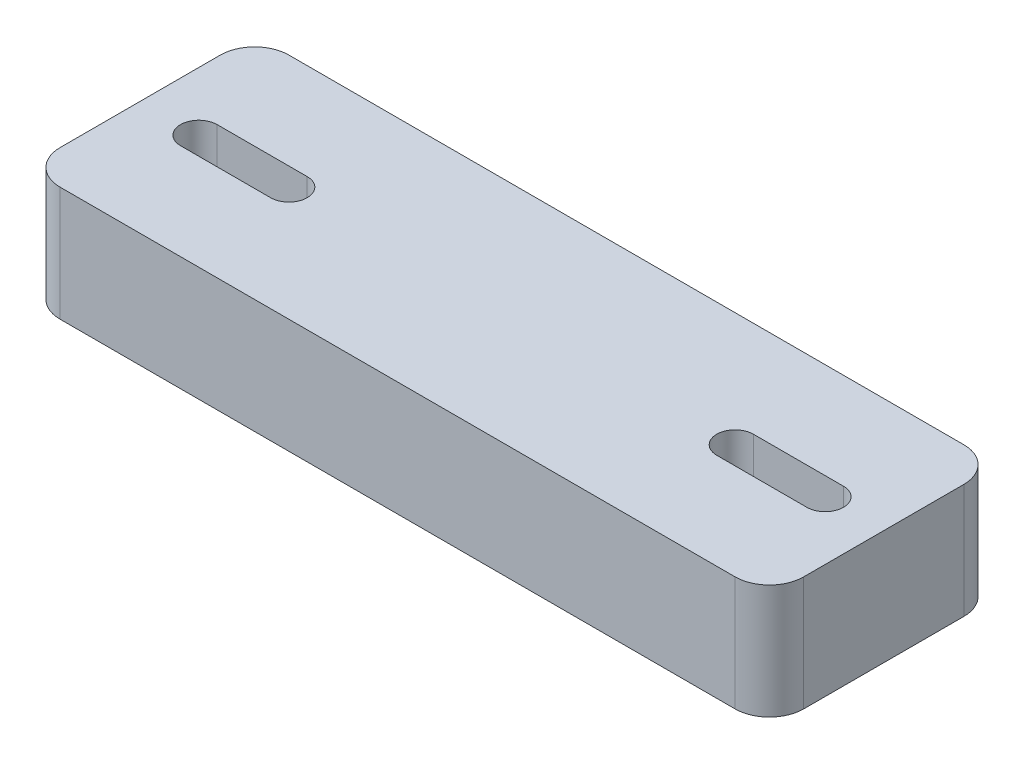
ISO-10303-21;
HEADER;
FILE_DESCRIPTION(('STEP AP214'),'2;1');
FILE_NAME('part.step','',(''),(''),'','','');
FILE_SCHEMA(('AUTOMOTIVE_DESIGN { 1 0 10303 214 1 1 1 1 }'));
ENDSEC;
DATA;
#1=APPLICATION_CONTEXT('core data for automotive mechanical design processes');
#2=APPLICATION_PROTOCOL_DEFINITION('international standard','automotive_design',2000,#1);
#3=PRODUCT_CONTEXT('',#1,'mechanical');
#4=PRODUCT('Part','Part','',(#3));
#5=PRODUCT_RELATED_PRODUCT_CATEGORY('part','',(#4));
#6=PRODUCT_DEFINITION_FORMATION('','',#4);
#7=PRODUCT_DEFINITION_CONTEXT('part definition',#1,'design');
#8=PRODUCT_DEFINITION('design','',#6,#7);
#9=PRODUCT_DEFINITION_SHAPE('','',#8);
#10=(LENGTH_UNIT() NAMED_UNIT(*) SI_UNIT(.MILLI.,.METRE.));
#11=(NAMED_UNIT(*) PLANE_ANGLE_UNIT() SI_UNIT($,.RADIAN.));
#12=(NAMED_UNIT(*) SI_UNIT($,.STERADIAN.) SOLID_ANGLE_UNIT());
#13=UNCERTAINTY_MEASURE_WITH_UNIT(LENGTH_MEASURE(1.E-05),#10,'distance_accuracy_value','');
#14=(GEOMETRIC_REPRESENTATION_CONTEXT(3) GLOBAL_UNCERTAINTY_ASSIGNED_CONTEXT((#13)) GLOBAL_UNIT_ASSIGNED_CONTEXT((#10,
#11,#12)) REPRESENTATION_CONTEXT('',''));
#15=CARTESIAN_POINT('',(0.,0.,0.));
#16=DIRECTION('',(0.,0.,1.));
#17=DIRECTION('',(1.,0.,0.));
#18=AXIS2_PLACEMENT_3D('',#15,#16,#17);
#19=CARTESIAN_POINT('',(32.5,10.,-10.));
#20=DIRECTION('',(-1.,0.,0.));
#21=DIRECTION('',(0.,0.,1.));
#22=AXIS2_PLACEMENT_3D('',#19,#20,#21);
#23=PLANE('',#22);
#24=DIRECTION('',(0.,0.,-1.));
#25=VECTOR('',#24,1.);
#26=CARTESIAN_POINT('',(32.5,0.,-10.));
#27=LINE('',#26,#25);
#28=CARTESIAN_POINT('',(32.5,0.,7.));
#29=VERTEX_POINT('',#28);
#30=CARTESIAN_POINT('',(32.5,0.,-7.));
#31=VERTEX_POINT('',#30);
#32=EDGE_CURVE('E189',#29,#31,#27,.T.);
#33=ORIENTED_EDGE('',*,*,#32,.T.);
#34=DIRECTION('',(0.,-1.,0.));
#35=VECTOR('',#34,1.);
#36=CARTESIAN_POINT('',(32.5,10.,-7.));
#37=LINE('',#36,#35);
#38=CARTESIAN_POINT('',(32.5,10.,-7.));
#39=VERTEX_POINT('',#38);
#40=EDGE_CURVE('E11',#31,#39,#37,.F.);
#41=ORIENTED_EDGE('',*,*,#40,.T.);
#42=DIRECTION('',(0.,0.,-1.));
#43=VECTOR('',#42,1.);
#44=CARTESIAN_POINT('',(32.5,10.,-10.));
#45=LINE('',#44,#43);
#46=CARTESIAN_POINT('',(32.5,10.,7.));
#47=VERTEX_POINT('',#46);
#48=EDGE_CURVE('E224',#47,#39,#45,.T.);
#49=ORIENTED_EDGE('',*,*,#48,.F.);
#50=DIRECTION('',(0.,-1.,0.));
#51=VECTOR('',#50,1.);
#52=CARTESIAN_POINT('',(32.5,10.,7.));
#53=LINE('',#52,#51);
#54=EDGE_CURVE('E42',#47,#29,#53,.T.);
#55=ORIENTED_EDGE('',*,*,#54,.T.);
#56=EDGE_LOOP('',(#33,#41,#49,#55));
#57=FACE_BOUND('',#56,.T.);
#58=ADVANCED_FACE('F34',(#57),#23,.F.);
#59=CARTESIAN_POINT('',(-32.5,10.,-10.));
#60=DIRECTION('',(0.,0.,1.));
#61=DIRECTION('',(1.,0.,0.));
#62=AXIS2_PLACEMENT_3D('',#59,#60,#61);
#63=PLANE('',#62);
#64=DIRECTION('',(-1.,0.,0.));
#65=VECTOR('',#64,1.);
#66=CARTESIAN_POINT('',(-32.5,0.,-10.));
#67=LINE('',#66,#65);
#68=CARTESIAN_POINT('',(29.5,0.,-10.));
#69=VERTEX_POINT('',#68);
#70=CARTESIAN_POINT('',(-29.5,0.,-10.));
#71=VERTEX_POINT('',#70);
#72=EDGE_CURVE('E238',#69,#71,#67,.T.);
#73=ORIENTED_EDGE('',*,*,#72,.T.);
#74=DIRECTION('',(0.,-1.,0.));
#75=VECTOR('',#74,1.);
#76=CARTESIAN_POINT('',(-29.5,10.,-10.));
#77=LINE('',#76,#75);
#78=CARTESIAN_POINT('',(-29.5,10.,-10.));
#79=VERTEX_POINT('',#78);
#80=EDGE_CURVE('E260',#71,#79,#77,.F.);
#81=ORIENTED_EDGE('',*,*,#80,.T.);
#82=DIRECTION('',(-1.,0.,0.));
#83=VECTOR('',#82,1.);
#84=CARTESIAN_POINT('',(-32.5,10.,-10.));
#85=LINE('',#84,#83);
#86=CARTESIAN_POINT('',(29.5,10.,-10.));
#87=VERTEX_POINT('',#86);
#88=EDGE_CURVE('E227',#87,#79,#85,.T.);
#89=ORIENTED_EDGE('',*,*,#88,.F.);
#90=DIRECTION('',(0.,-1.,0.));
#91=VECTOR('',#90,1.);
#92=CARTESIAN_POINT('',(29.5,10.,-10.));
#93=LINE('',#92,#91);
#94=EDGE_CURVE('E257',#87,#69,#93,.T.);
#95=ORIENTED_EDGE('',*,*,#94,.T.);
#96=EDGE_LOOP('',(#73,#81,#89,#95));
#97=FACE_BOUND('',#96,.T.);
#98=ADVANCED_FACE('F290',(#97),#63,.F.);
#99=CARTESIAN_POINT('',(-32.5,10.,-10.));
#100=DIRECTION('',(1.,0.,0.));
#101=DIRECTION('',(0.,0.,-1.));
#102=AXIS2_PLACEMENT_3D('',#99,#100,#101);
#103=PLANE('',#102);
#104=DIRECTION('',(0.,0.,1.));
#105=VECTOR('',#104,1.);
#106=CARTESIAN_POINT('',(-32.5,10.,-10.));
#107=LINE('',#106,#105);
#108=CARTESIAN_POINT('',(-32.5,10.,-7.));
#109=VERTEX_POINT('',#108);
#110=CARTESIAN_POINT('',(-32.5,10.,7.));
#111=VERTEX_POINT('',#110);
#112=EDGE_CURVE('E231',#109,#111,#107,.T.);
#113=ORIENTED_EDGE('',*,*,#112,.F.);
#114=DIRECTION('',(0.,-1.,0.));
#115=VECTOR('',#114,1.);
#116=CARTESIAN_POINT('',(-32.5,10.,-7.));
#117=LINE('',#116,#115);
#118=CARTESIAN_POINT('',(-32.5,0.,-7.));
#119=VERTEX_POINT('',#118);
#120=EDGE_CURVE('E246',#109,#119,#117,.T.);
#121=ORIENTED_EDGE('',*,*,#120,.T.);
#122=DIRECTION('',(0.,0.,1.));
#123=VECTOR('',#122,1.);
#124=CARTESIAN_POINT('',(-32.5,0.,-10.));
#125=LINE('',#124,#123);
#126=CARTESIAN_POINT('',(-32.5,0.,7.));
#127=VERTEX_POINT('',#126);
#128=EDGE_CURVE('E241',#119,#127,#125,.T.);
#129=ORIENTED_EDGE('',*,*,#128,.T.);
#130=DIRECTION('',(0.,-1.,0.));
#131=VECTOR('',#130,1.);
#132=CARTESIAN_POINT('',(-32.5,10.,7.));
#133=LINE('',#132,#131);
#134=EDGE_CURVE('E235',#127,#111,#133,.F.);
#135=ORIENTED_EDGE('',*,*,#134,.T.);
#136=EDGE_LOOP('',(#113,#121,#129,#135));
#137=FACE_BOUND('',#136,.T.);
#138=ADVANCED_FACE('F299',(#137),#103,.F.);
#139=CARTESIAN_POINT('',(-32.5,10.,10.));
#140=DIRECTION('',(0.,0.,-1.));
#141=DIRECTION('',(-1.,0.,0.));
#142=AXIS2_PLACEMENT_3D('',#139,#140,#141);
#143=PLANE('',#142);
#144=DIRECTION('',(1.,0.,0.));
#145=VECTOR('',#144,1.);
#146=CARTESIAN_POINT('',(-32.5,10.,10.));
#147=LINE('',#146,#145);
#148=CARTESIAN_POINT('',(-29.5,10.,10.));
#149=VERTEX_POINT('',#148);
#150=CARTESIAN_POINT('',(29.5,10.,10.));
#151=VERTEX_POINT('',#150);
#152=EDGE_CURVE('E233',#149,#151,#147,.T.);
#153=ORIENTED_EDGE('',*,*,#152,.F.);
#154=DIRECTION('',(0.,-1.,0.));
#155=VECTOR('',#154,1.);
#156=CARTESIAN_POINT('',(-29.5,10.,10.));
#157=LINE('',#156,#155);
#158=CARTESIAN_POINT('',(-29.5,0.,10.));
#159=VERTEX_POINT('',#158);
#160=EDGE_CURVE('E270',#149,#159,#157,.T.);
#161=ORIENTED_EDGE('',*,*,#160,.T.);
#162=DIRECTION('',(1.,0.,0.));
#163=VECTOR('',#162,1.);
#164=CARTESIAN_POINT('',(-32.5,0.,10.));
#165=LINE('',#164,#163);
#166=CARTESIAN_POINT('',(29.5,0.,10.));
#167=VERTEX_POINT('',#166);
#168=EDGE_CURVE('E228',#159,#167,#165,.T.);
#169=ORIENTED_EDGE('',*,*,#168,.T.);
#170=DIRECTION('',(0.,-1.,0.));
#171=VECTOR('',#170,1.);
#172=CARTESIAN_POINT('',(29.5,10.,10.));
#173=LINE('',#172,#171);
#174=EDGE_CURVE('E49',#167,#151,#173,.F.);
#175=ORIENTED_EDGE('',*,*,#174,.T.);
#176=EDGE_LOOP('',(#153,#161,#169,#175));
#177=FACE_BOUND('',#176,.T.);
#178=ADVANCED_FACE('F304',(#177),#143,.F.);
#179=CARTESIAN_POINT('',(0.,10.,0.));
#180=DIRECTION('',(0.,1.,0.));
#181=DIRECTION('',(0.,0.,1.));
#182=AXIS2_PLACEMENT_3D('',#179,#180,#181);
#183=PLANE('',#182);
#184=CARTESIAN_POINT('',(-27.375,10.,0.));
#185=DIRECTION('',(0.,1.,0.));
#186=DIRECTION('',(0.,0.,1.));
#187=AXIS2_PLACEMENT_3D('',#184,#185,#186);
#188=CIRCLE('',#187,1.59999999999999);
#189=CARTESIAN_POINT('',(-27.375,10.,-1.59999999999998));
#190=VERTEX_POINT('',#189);
#191=CARTESIAN_POINT('',(-27.375,10.,1.59999999999999));
#192=VERTEX_POINT('',#191);
#193=EDGE_CURVE('E155',#190,#192,#188,.T.);
#194=ORIENTED_EDGE('',*,*,#193,.F.);
#195=DIRECTION('',(-1.,0.,0.));
#196=VECTOR('',#195,1.);
#197=CARTESIAN_POINT('',(-27.375,10.,-1.59999999999998));
#198=LINE('',#197,#196);
#199=CARTESIAN_POINT('',(-19.5,10.,-1.59999999999998));
#200=VERTEX_POINT('',#199);
#201=EDGE_CURVE('E173',#200,#190,#198,.T.);
#202=ORIENTED_EDGE('',*,*,#201,.F.);
#203=CARTESIAN_POINT('',(-19.5,10.,0.));
#204=DIRECTION('',(0.,1.,0.));
#205=DIRECTION('',(0.,0.,1.));
#206=AXIS2_PLACEMENT_3D('',#203,#204,#205);
#207=CIRCLE('',#206,1.59999999999999);
#208=CARTESIAN_POINT('',(-19.5,10.,1.59999999999999));
#209=VERTEX_POINT('',#208);
#210=EDGE_CURVE('E176',#209,#200,#207,.T.);
#211=ORIENTED_EDGE('',*,*,#210,.F.);
#212=DIRECTION('',(1.,0.,0.));
#213=VECTOR('',#212,1.);
#214=CARTESIAN_POINT('',(-27.375,10.,1.59999999999999));
#215=LINE('',#214,#213);
#216=EDGE_CURVE('E182',#192,#209,#215,.T.);
#217=ORIENTED_EDGE('',*,*,#216,.F.);
#218=EDGE_LOOP('',(#194,#202,#211,#217));
#219=FACE_BOUND('',#218,.T.);
#220=CARTESIAN_POINT('',(27.375,10.,0.));
#221=DIRECTION('',(0.,1.,0.));
#222=DIRECTION('',(0.,0.,-1.));
#223=AXIS2_PLACEMENT_3D('',#220,#221,#222);
#224=CIRCLE('',#223,1.59999999999999);
#225=CARTESIAN_POINT('',(27.375,10.,1.59999999999998));
#226=VERTEX_POINT('',#225);
#227=CARTESIAN_POINT('',(27.375,10.,-1.59999999999999));
#228=VERTEX_POINT('',#227);
#229=EDGE_CURVE('E207',#226,#228,#224,.T.);
#230=ORIENTED_EDGE('',*,*,#229,.F.);
#231=DIRECTION('',(1.,0.,0.));
#232=VECTOR('',#231,1.);
#233=CARTESIAN_POINT('',(27.375,10.,1.59999999999998));
#234=LINE('',#233,#232);
#235=CARTESIAN_POINT('',(19.5,10.,1.59999999999999));
#236=VERTEX_POINT('',#235);
#237=EDGE_CURVE('E197',#236,#226,#234,.T.);
#238=ORIENTED_EDGE('',*,*,#237,.F.);
#239=CARTESIAN_POINT('',(19.5,10.,0.));
#240=DIRECTION('',(0.,1.,0.));
#241=DIRECTION('',(0.,0.,-1.));
#242=AXIS2_PLACEMENT_3D('',#239,#240,#241);
#243=CIRCLE('',#242,1.59999999999999);
#244=CARTESIAN_POINT('',(19.5,10.,-1.59999999999999));
#245=VERTEX_POINT('',#244);
#246=EDGE_CURVE('E212',#245,#236,#243,.T.);
#247=ORIENTED_EDGE('',*,*,#246,.F.);
#248=DIRECTION('',(-1.,0.,0.));
#249=VECTOR('',#248,1.);
#250=CARTESIAN_POINT('',(27.375,10.,-1.59999999999999));
#251=LINE('',#250,#249);
#252=EDGE_CURVE('E209',#228,#245,#251,.T.);
#253=ORIENTED_EDGE('',*,*,#252,.F.);
#254=EDGE_LOOP('',(#230,#238,#247,#253));
#255=FACE_BOUND('',#254,.T.);
#256=ORIENTED_EDGE('',*,*,#88,.T.);
#257=CARTESIAN_POINT('',(-29.5,10.,-7.));
#258=DIRECTION('',(0.,1.,0.));
#259=DIRECTION('',(0.,0.,1.));
#260=AXIS2_PLACEMENT_3D('',#257,#258,#259);
#261=CIRCLE('',#260,3.);
#262=EDGE_CURVE('E267',#79,#109,#261,.T.);
#263=ORIENTED_EDGE('',*,*,#262,.T.);
#264=ORIENTED_EDGE('',*,*,#112,.T.);
#265=CARTESIAN_POINT('',(-29.5,10.,7.));
#266=DIRECTION('',(0.,1.,0.));
#267=DIRECTION('',(0.,0.,1.));
#268=AXIS2_PLACEMENT_3D('',#265,#266,#267);
#269=CIRCLE('',#268,3.);
#270=EDGE_CURVE('E56',#111,#149,#269,.T.);
#271=ORIENTED_EDGE('',*,*,#270,.T.);
#272=ORIENTED_EDGE('',*,*,#152,.T.);
#273=CARTESIAN_POINT('',(29.5,10.,7.));
#274=DIRECTION('',(0.,1.,0.));
#275=DIRECTION('',(0.,0.,1.));
#276=AXIS2_PLACEMENT_3D('',#273,#274,#275);
#277=CIRCLE('',#276,3.);
#278=EDGE_CURVE('E262',#151,#47,#277,.T.);
#279=ORIENTED_EDGE('',*,*,#278,.T.);
#280=ORIENTED_EDGE('',*,*,#48,.T.);
#281=CARTESIAN_POINT('',(29.5,10.,-7.));
#282=DIRECTION('',(0.,1.,0.));
#283=DIRECTION('',(0.,0.,1.));
#284=AXIS2_PLACEMENT_3D('',#281,#282,#283);
#285=CIRCLE('',#284,3.);
#286=EDGE_CURVE('E264',#39,#87,#285,.T.);
#287=ORIENTED_EDGE('',*,*,#286,.T.);
#288=EDGE_LOOP('',(#256,#263,#264,#271,#272,#279,#280,#287));
#289=FACE_BOUND('',#288,.T.);
#290=ADVANCED_FACE('F293',(#219,#255,#289),#183,.T.);
#291=CARTESIAN_POINT('',(0.,0.,0.));
#292=DIRECTION('',(0.,1.,0.));
#293=DIRECTION('',(0.,0.,1.));
#294=AXIS2_PLACEMENT_3D('',#291,#292,#293);
#295=PLANE('',#294);
#296=DIRECTION('',(-1.,0.,0.));
#297=VECTOR('',#296,1.);
#298=CARTESIAN_POINT('',(-27.375,0.,-1.59999999999998));
#299=LINE('',#298,#297);
#300=CARTESIAN_POINT('',(-19.5,0.,-1.59999999999998));
#301=VERTEX_POINT('',#300);
#302=CARTESIAN_POINT('',(-27.375,0.,-1.59999999999998));
#303=VERTEX_POINT('',#302);
#304=EDGE_CURVE('E160',#301,#303,#299,.T.);
#305=ORIENTED_EDGE('',*,*,#304,.T.);
#306=CARTESIAN_POINT('',(-27.375,0.,0.));
#307=DIRECTION('',(0.,1.,0.));
#308=DIRECTION('',(0.,0.,1.));
#309=AXIS2_PLACEMENT_3D('',#306,#307,#308);
#310=CIRCLE('',#309,1.59999999999999);
#311=CARTESIAN_POINT('',(-27.375,0.,1.59999999999999));
#312=VERTEX_POINT('',#311);
#313=EDGE_CURVE('E152',#303,#312,#310,.T.);
#314=ORIENTED_EDGE('',*,*,#313,.T.);
#315=DIRECTION('',(1.,0.,0.));
#316=VECTOR('',#315,1.);
#317=CARTESIAN_POINT('',(-27.375,0.,1.59999999999999));
#318=LINE('',#317,#316);
#319=CARTESIAN_POINT('',(-19.5,0.,1.59999999999999));
#320=VERTEX_POINT('',#319);
#321=EDGE_CURVE('E164',#312,#320,#318,.T.);
#322=ORIENTED_EDGE('',*,*,#321,.T.);
#323=CARTESIAN_POINT('',(-19.5,0.,0.));
#324=DIRECTION('',(0.,1.,0.));
#325=DIRECTION('',(0.,0.,1.));
#326=AXIS2_PLACEMENT_3D('',#323,#324,#325);
#327=CIRCLE('',#326,1.59999999999999);
#328=EDGE_CURVE('E168',#320,#301,#327,.T.);
#329=ORIENTED_EDGE('',*,*,#328,.T.);
#330=EDGE_LOOP('',(#305,#314,#322,#329));
#331=FACE_BOUND('',#330,.T.);
#332=DIRECTION('',(1.,0.,0.));
#333=VECTOR('',#332,1.);
#334=CARTESIAN_POINT('',(27.375,0.,1.59999999999998));
#335=LINE('',#334,#333);
#336=CARTESIAN_POINT('',(19.5,0.,1.59999999999999));
#337=VERTEX_POINT('',#336);
#338=CARTESIAN_POINT('',(27.375,0.,1.59999999999998));
#339=VERTEX_POINT('',#338);
#340=EDGE_CURVE('E203',#337,#339,#335,.T.);
#341=ORIENTED_EDGE('',*,*,#340,.T.);
#342=CARTESIAN_POINT('',(27.375,0.,0.));
#343=DIRECTION('',(0.,1.,0.));
#344=DIRECTION('',(0.,0.,-1.));
#345=AXIS2_PLACEMENT_3D('',#342,#343,#344);
#346=CIRCLE('',#345,1.59999999999999);
#347=CARTESIAN_POINT('',(27.375,0.,-1.59999999999999));
#348=VERTEX_POINT('',#347);
#349=EDGE_CURVE('E193',#339,#348,#346,.T.);
#350=ORIENTED_EDGE('',*,*,#349,.T.);
#351=DIRECTION('',(-1.,0.,0.));
#352=VECTOR('',#351,1.);
#353=CARTESIAN_POINT('',(27.375,0.,-1.59999999999999));
#354=LINE('',#353,#352);
#355=CARTESIAN_POINT('',(19.5,0.,-1.59999999999999));
#356=VERTEX_POINT('',#355);
#357=EDGE_CURVE('E196',#348,#356,#354,.T.);
#358=ORIENTED_EDGE('',*,*,#357,.T.);
#359=CARTESIAN_POINT('',(19.5,0.,0.));
#360=DIRECTION('',(0.,1.,0.));
#361=DIRECTION('',(0.,0.,-1.));
#362=AXIS2_PLACEMENT_3D('',#359,#360,#361);
#363=CIRCLE('',#362,1.59999999999999);
#364=EDGE_CURVE('E200',#356,#337,#363,.T.);
#365=ORIENTED_EDGE('',*,*,#364,.T.);
#366=EDGE_LOOP('',(#341,#350,#358,#365));
#367=FACE_BOUND('',#366,.T.);
#368=ORIENTED_EDGE('',*,*,#128,.F.);
#369=CARTESIAN_POINT('',(-29.5,0.,-7.));
#370=DIRECTION('',(0.,1.,0.));
#371=DIRECTION('',(0.,0.,1.));
#372=AXIS2_PLACEMENT_3D('',#369,#370,#371);
#373=CIRCLE('',#372,3.);
#374=EDGE_CURVE('E255',#119,#71,#373,.F.);
#375=ORIENTED_EDGE('',*,*,#374,.T.);
#376=ORIENTED_EDGE('',*,*,#72,.F.);
#377=CARTESIAN_POINT('',(29.5,0.,-7.));
#378=DIRECTION('',(0.,1.,0.));
#379=DIRECTION('',(0.,0.,1.));
#380=AXIS2_PLACEMENT_3D('',#377,#378,#379);
#381=CIRCLE('',#380,3.);
#382=EDGE_CURVE('E251',#69,#31,#381,.F.);
#383=ORIENTED_EDGE('',*,*,#382,.T.);
#384=ORIENTED_EDGE('',*,*,#32,.F.);
#385=CARTESIAN_POINT('',(29.5,0.,7.));
#386=DIRECTION('',(0.,1.,0.));
#387=DIRECTION('',(0.,0.,1.));
#388=AXIS2_PLACEMENT_3D('',#385,#386,#387);
#389=CIRCLE('',#388,3.);
#390=EDGE_CURVE('E249',#29,#167,#389,.F.);
#391=ORIENTED_EDGE('',*,*,#390,.T.);
#392=ORIENTED_EDGE('',*,*,#168,.F.);
#393=CARTESIAN_POINT('',(-29.5,0.,7.));
#394=DIRECTION('',(0.,1.,0.));
#395=DIRECTION('',(0.,0.,1.));
#396=AXIS2_PLACEMENT_3D('',#393,#394,#395);
#397=CIRCLE('',#396,3.);
#398=EDGE_CURVE('E253',#159,#127,#397,.F.);
#399=ORIENTED_EDGE('',*,*,#398,.T.);
#400=EDGE_LOOP('',(#368,#375,#376,#383,#384,#391,#392,#399));
#401=FACE_BOUND('',#400,.T.);
#402=ADVANCED_FACE('F170',(#331,#367,#401),#295,.F.);
#403=CARTESIAN_POINT('',(27.375,0.,0.));
#404=DIRECTION('',(0.,1.,0.));
#405=DIRECTION('',(0.,0.,1.));
#406=AXIS2_PLACEMENT_3D('',#403,#404,#405);
#407=CYLINDRICAL_SURFACE('',#406,1.59999999999999);
#408=ORIENTED_EDGE('',*,*,#229,.T.);
#409=DIRECTION('',(0.,1.,0.));
#410=VECTOR('',#409,1.);
#411=CARTESIAN_POINT('',(27.375,0.,-1.59999999999999));
#412=LINE('',#411,#410);
#413=EDGE_CURVE('E206',#348,#228,#412,.T.);
#414=ORIENTED_EDGE('',*,*,#413,.F.);
#415=ORIENTED_EDGE('',*,*,#349,.F.);
#416=DIRECTION('',(0.,1.,0.));
#417=VECTOR('',#416,1.);
#418=CARTESIAN_POINT('',(27.375,0.,1.59999999999998));
#419=LINE('',#418,#417);
#420=EDGE_CURVE('E183',#339,#226,#419,.T.);
#421=ORIENTED_EDGE('',*,*,#420,.T.);
#422=EDGE_LOOP('',(#408,#414,#415,#421));
#423=FACE_BOUND('',#422,.T.);
#424=ADVANCED_FACE('F400',(#423),#407,.F.);
#425=CARTESIAN_POINT('',(27.375,0.,1.59999999999998));
#426=DIRECTION('',(0.,0.,1.));
#427=DIRECTION('',(1.,0.,0.));
#428=AXIS2_PLACEMENT_3D('',#425,#426,#427);
#429=PLANE('',#428);
#430=ORIENTED_EDGE('',*,*,#237,.T.);
#431=ORIENTED_EDGE('',*,*,#420,.F.);
#432=ORIENTED_EDGE('',*,*,#340,.F.);
#433=DIRECTION('',(0.,1.,0.));
#434=VECTOR('',#433,1.);
#435=CARTESIAN_POINT('',(19.5,0.,1.59999999999999));
#436=LINE('',#435,#434);
#437=EDGE_CURVE('E218',#337,#236,#436,.T.);
#438=ORIENTED_EDGE('',*,*,#437,.T.);
#439=EDGE_LOOP('',(#430,#431,#432,#438));
#440=FACE_BOUND('',#439,.T.);
#441=ADVANCED_FACE('F391',(#440),#429,.F.);
#442=CARTESIAN_POINT('',(19.5,0.,0.));
#443=DIRECTION('',(0.,1.,0.));
#444=DIRECTION('',(0.,0.,1.));
#445=AXIS2_PLACEMENT_3D('',#442,#443,#444);
#446=CYLINDRICAL_SURFACE('',#445,1.59999999999999);
#447=ORIENTED_EDGE('',*,*,#246,.T.);
#448=ORIENTED_EDGE('',*,*,#437,.F.);
#449=ORIENTED_EDGE('',*,*,#364,.F.);
#450=DIRECTION('',(0.,1.,0.));
#451=VECTOR('',#450,1.);
#452=CARTESIAN_POINT('',(19.5,0.,-1.59999999999999));
#453=LINE('',#452,#451);
#454=EDGE_CURVE('E220',#356,#245,#453,.T.);
#455=ORIENTED_EDGE('',*,*,#454,.T.);
#456=EDGE_LOOP('',(#447,#448,#449,#455));
#457=FACE_BOUND('',#456,.T.);
#458=ADVANCED_FACE('F382',(#457),#446,.F.);
#459=CARTESIAN_POINT('',(27.375,0.,-1.59999999999999));
#460=DIRECTION('',(0.,0.,-1.));
#461=DIRECTION('',(-1.,0.,0.));
#462=AXIS2_PLACEMENT_3D('',#459,#460,#461);
#463=PLANE('',#462);
#464=ORIENTED_EDGE('',*,*,#252,.T.);
#465=ORIENTED_EDGE('',*,*,#454,.F.);
#466=ORIENTED_EDGE('',*,*,#357,.F.);
#467=ORIENTED_EDGE('',*,*,#413,.T.);
#468=EDGE_LOOP('',(#464,#465,#466,#467));
#469=FACE_BOUND('',#468,.T.);
#470=ADVANCED_FACE('F374',(#469),#463,.F.);
#471=CARTESIAN_POINT('',(-27.375,0.,0.));
#472=DIRECTION('',(0.,1.,0.));
#473=DIRECTION('',(0.,0.,1.));
#474=AXIS2_PLACEMENT_3D('',#471,#472,#473);
#475=CYLINDRICAL_SURFACE('',#474,1.59999999999999);
#476=ORIENTED_EDGE('',*,*,#193,.T.);
#477=DIRECTION('',(0.,1.,0.));
#478=VECTOR('',#477,1.);
#479=CARTESIAN_POINT('',(-27.375,0.,1.59999999999999));
#480=LINE('',#479,#478);
#481=EDGE_CURVE('E148',#312,#192,#480,.T.);
#482=ORIENTED_EDGE('',*,*,#481,.F.);
#483=ORIENTED_EDGE('',*,*,#313,.F.);
#484=DIRECTION('',(0.,1.,0.));
#485=VECTOR('',#484,1.);
#486=CARTESIAN_POINT('',(-27.375,0.,-1.59999999999998));
#487=LINE('',#486,#485);
#488=EDGE_CURVE('E187',#303,#190,#487,.T.);
#489=ORIENTED_EDGE('',*,*,#488,.T.);
#490=EDGE_LOOP('',(#476,#482,#483,#489));
#491=FACE_BOUND('',#490,.T.);
#492=ADVANCED_FACE('F150',(#491),#475,.F.);
#493=CARTESIAN_POINT('',(-27.375,0.,-1.59999999999998));
#494=DIRECTION('',(0.,0.,-1.));
#495=DIRECTION('',(-1.,0.,0.));
#496=AXIS2_PLACEMENT_3D('',#493,#494,#495);
#497=PLANE('',#496);
#498=ORIENTED_EDGE('',*,*,#201,.T.);
#499=ORIENTED_EDGE('',*,*,#488,.F.);
#500=ORIENTED_EDGE('',*,*,#304,.F.);
#501=DIRECTION('',(0.,1.,0.));
#502=VECTOR('',#501,1.);
#503=CARTESIAN_POINT('',(-19.5,0.,-1.59999999999998));
#504=LINE('',#503,#502);
#505=EDGE_CURVE('E190',#301,#200,#504,.T.);
#506=ORIENTED_EDGE('',*,*,#505,.T.);
#507=EDGE_LOOP('',(#498,#499,#500,#506));
#508=FACE_BOUND('',#507,.T.);
#509=ADVANCED_FACE('F357',(#508),#497,.F.);
#510=CARTESIAN_POINT('',(-19.5,0.,0.));
#511=DIRECTION('',(0.,1.,0.));
#512=DIRECTION('',(0.,0.,1.));
#513=AXIS2_PLACEMENT_3D('',#510,#511,#512);
#514=CYLINDRICAL_SURFACE('',#513,1.59999999999999);
#515=ORIENTED_EDGE('',*,*,#210,.T.);
#516=ORIENTED_EDGE('',*,*,#505,.F.);
#517=ORIENTED_EDGE('',*,*,#328,.F.);
#518=DIRECTION('',(0.,1.,0.));
#519=VECTOR('',#518,1.);
#520=CARTESIAN_POINT('',(-19.5,0.,1.59999999999999));
#521=LINE('',#520,#519);
#522=EDGE_CURVE('E159',#320,#209,#521,.T.);
#523=ORIENTED_EDGE('',*,*,#522,.T.);
#524=EDGE_LOOP('',(#515,#516,#517,#523));
#525=FACE_BOUND('',#524,.T.);
#526=ADVANCED_FACE('F349',(#525),#514,.F.);
#527=CARTESIAN_POINT('',(-27.375,0.,1.59999999999999));
#528=DIRECTION('',(0.,0.,1.));
#529=DIRECTION('',(1.,0.,0.));
#530=AXIS2_PLACEMENT_3D('',#527,#528,#529);
#531=PLANE('',#530);
#532=ORIENTED_EDGE('',*,*,#216,.T.);
#533=ORIENTED_EDGE('',*,*,#522,.F.);
#534=ORIENTED_EDGE('',*,*,#321,.F.);
#535=ORIENTED_EDGE('',*,*,#481,.T.);
#536=EDGE_LOOP('',(#532,#533,#534,#535));
#537=FACE_BOUND('',#536,.T.);
#538=ADVANCED_FACE('F165',(#537),#531,.F.);
#539=CARTESIAN_POINT('',(-29.5,10.,-7.));
#540=DIRECTION('',(0.,-1.,0.));
#541=DIRECTION('',(0.,0.,-1.));
#542=AXIS2_PLACEMENT_3D('',#539,#540,#541);
#543=CYLINDRICAL_SURFACE('',#542,3.);
#544=ORIENTED_EDGE('',*,*,#262,.F.);
#545=ORIENTED_EDGE('',*,*,#80,.F.);
#546=ORIENTED_EDGE('',*,*,#374,.F.);
#547=ORIENTED_EDGE('',*,*,#120,.F.);
#548=EDGE_LOOP('',(#544,#545,#546,#547));
#549=FACE_BOUND('',#548,.T.);
#550=ADVANCED_FACE('F297',(#549),#543,.T.);
#551=CARTESIAN_POINT('',(-29.5,10.,7.));
#552=DIRECTION('',(0.,-1.,0.));
#553=DIRECTION('',(0.,0.,-1.));
#554=AXIS2_PLACEMENT_3D('',#551,#552,#553);
#555=CYLINDRICAL_SURFACE('',#554,3.);
#556=ORIENTED_EDGE('',*,*,#270,.F.);
#557=ORIENTED_EDGE('',*,*,#134,.F.);
#558=ORIENTED_EDGE('',*,*,#398,.F.);
#559=ORIENTED_EDGE('',*,*,#160,.F.);
#560=EDGE_LOOP('',(#556,#557,#558,#559));
#561=FACE_BOUND('',#560,.T.);
#562=ADVANCED_FACE('F303',(#561),#555,.T.);
#563=CARTESIAN_POINT('',(29.5,10.,-7.));
#564=DIRECTION('',(0.,-1.,0.));
#565=DIRECTION('',(0.,0.,-1.));
#566=AXIS2_PLACEMENT_3D('',#563,#564,#565);
#567=CYLINDRICAL_SURFACE('',#566,3.);
#568=ORIENTED_EDGE('',*,*,#286,.F.);
#569=ORIENTED_EDGE('',*,*,#40,.F.);
#570=ORIENTED_EDGE('',*,*,#382,.F.);
#571=ORIENTED_EDGE('',*,*,#94,.F.);
#572=EDGE_LOOP('',(#568,#569,#570,#571));
#573=FACE_BOUND('',#572,.T.);
#574=ADVANCED_FACE('F287',(#573),#567,.T.);
#575=CARTESIAN_POINT('',(29.5,10.,7.));
#576=DIRECTION('',(0.,-1.,0.));
#577=DIRECTION('',(0.,0.,-1.));
#578=AXIS2_PLACEMENT_3D('',#575,#576,#577);
#579=CYLINDRICAL_SURFACE('',#578,3.);
#580=ORIENTED_EDGE('',*,*,#278,.F.);
#581=ORIENTED_EDGE('',*,*,#174,.F.);
#582=ORIENTED_EDGE('',*,*,#390,.F.);
#583=ORIENTED_EDGE('',*,*,#54,.F.);
#584=EDGE_LOOP('',(#580,#581,#582,#583));
#585=FACE_BOUND('',#584,.T.);
#586=ADVANCED_FACE('F36',(#585),#579,.T.);
#587=CLOSED_SHELL('',(#58,#98,#138,#178,#290,#402,#424,#441,#458,#470,#492,#509,#526,#538,#550,
#562,#574,#586));
#588=MANIFOLD_SOLID_BREP('B2',#587);
#589=ADVANCED_BREP_SHAPE_REPRESENTATION('',(#18,#588),#14);
#590=SHAPE_DEFINITION_REPRESENTATION(#9,#589);
ENDSEC;
END-ISO-10303-21;
